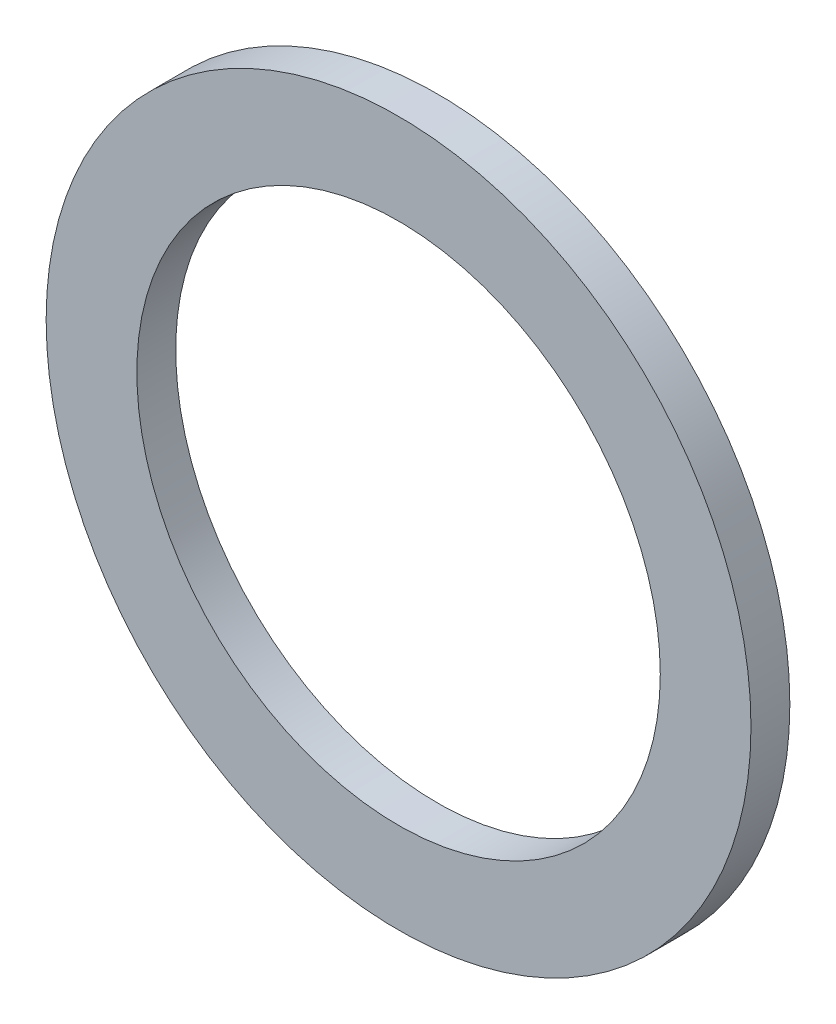
ISO-10303-21;
HEADER;
FILE_DESCRIPTION(('STEP AP214'),'2;1');
FILE_NAME('part.step','',(''),(''),'','','');
FILE_SCHEMA(('AUTOMOTIVE_DESIGN { 1 0 10303 214 1 1 1 1 }'));
ENDSEC;
DATA;
#1=APPLICATION_CONTEXT('core data for automotive mechanical design processes');
#2=APPLICATION_PROTOCOL_DEFINITION('international standard','automotive_design',2000,#1);
#3=PRODUCT_CONTEXT('',#1,'mechanical');
#4=PRODUCT('Part','Part','',(#3));
#5=PRODUCT_RELATED_PRODUCT_CATEGORY('part','',(#4));
#6=PRODUCT_DEFINITION_FORMATION('','',#4);
#7=PRODUCT_DEFINITION_CONTEXT('part definition',#1,'design');
#8=PRODUCT_DEFINITION('design','',#6,#7);
#9=PRODUCT_DEFINITION_SHAPE('','',#8);
#10=(LENGTH_UNIT() NAMED_UNIT(*) SI_UNIT(.MILLI.,.METRE.));
#11=(NAMED_UNIT(*) PLANE_ANGLE_UNIT() SI_UNIT($,.RADIAN.));
#12=(NAMED_UNIT(*) SI_UNIT($,.STERADIAN.) SOLID_ANGLE_UNIT());
#13=UNCERTAINTY_MEASURE_WITH_UNIT(LENGTH_MEASURE(1.E-05),#10,'distance_accuracy_value','');
#14=(GEOMETRIC_REPRESENTATION_CONTEXT(3) GLOBAL_UNCERTAINTY_ASSIGNED_CONTEXT((#13)) GLOBAL_UNIT_ASSIGNED_CONTEXT((#10,
#11,#12)) REPRESENTATION_CONTEXT('',''));
#15=CARTESIAN_POINT('',(0.,0.,0.));
#16=DIRECTION('',(0.,0.,1.));
#17=DIRECTION('',(1.,0.,0.));
#18=AXIS2_PLACEMENT_3D('',#15,#16,#17);
#19=CARTESIAN_POINT('',(0.,0.,1.5));
#20=DIRECTION('',(0.,0.,-1.));
#21=DIRECTION('',(-1.,0.,0.));
#22=AXIS2_PLACEMENT_3D('',#19,#20,#21);
#23=CYLINDRICAL_SURFACE('',#22,13.6);
#24=CARTESIAN_POINT('',(0.,0.,1.5));
#25=DIRECTION('',(0.,0.,1.));
#26=DIRECTION('',(1.,0.,0.));
#27=AXIS2_PLACEMENT_3D('',#24,#25,#26);
#28=CIRCLE('',#27,13.6);
#29=CARTESIAN_POINT('',(13.6,0.,1.5));
#30=VERTEX_POINT('',#29);
#31=EDGE_CURVE('E10',#30,#30,#28,.T.);
#32=ORIENTED_EDGE('',*,*,#31,.F.);
#33=EDGE_LOOP('',(#32));
#34=FACE_BOUND('',#33,.T.);
#35=CARTESIAN_POINT('',(0.,0.,0.));
#36=DIRECTION('',(0.,0.,1.));
#37=DIRECTION('',(1.,0.,0.));
#38=AXIS2_PLACEMENT_3D('',#35,#36,#37);
#39=CIRCLE('',#38,13.6);
#40=CARTESIAN_POINT('',(13.6,0.,0.));
#41=VERTEX_POINT('',#40);
#42=EDGE_CURVE('E46',#41,#41,#39,.T.);
#43=ORIENTED_EDGE('',*,*,#42,.T.);
#44=EDGE_LOOP('',(#43));
#45=FACE_BOUND('',#44,.T.);
#46=ADVANCED_FACE('F43',(#34,#45),#23,.T.);
#47=CARTESIAN_POINT('',(0.,0.,1.5));
#48=DIRECTION('',(0.,0.,1.));
#49=DIRECTION('',(1.,0.,0.));
#50=AXIS2_PLACEMENT_3D('',#47,#48,#49);
#51=PLANE('',#50);
#52=CARTESIAN_POINT('',(0.,0.,1.5));
#53=DIRECTION('',(0.,0.,1.));
#54=DIRECTION('',(1.,0.,0.));
#55=AXIS2_PLACEMENT_3D('',#52,#53,#54);
#56=CIRCLE('',#55,10.1);
#57=CARTESIAN_POINT('',(10.1,0.,1.5));
#58=VERTEX_POINT('',#57);
#59=EDGE_CURVE('E57',#58,#58,#56,.T.);
#60=ORIENTED_EDGE('',*,*,#59,.F.);
#61=EDGE_LOOP('',(#60));
#62=FACE_BOUND('',#61,.T.);
#63=ORIENTED_EDGE('',*,*,#31,.T.);
#64=EDGE_LOOP('',(#63));
#65=FACE_BOUND('',#64,.T.);
#66=ADVANCED_FACE('F74',(#62,#65),#51,.T.);
#67=CARTESIAN_POINT('',(0.,0.,0.));
#68=DIRECTION('',(0.,0.,1.));
#69=DIRECTION('',(1.,0.,0.));
#70=AXIS2_PLACEMENT_3D('',#67,#68,#69);
#71=PLANE('',#70);
#72=CARTESIAN_POINT('',(0.,0.,0.));
#73=DIRECTION('',(0.,0.,1.));
#74=DIRECTION('',(1.,0.,0.));
#75=AXIS2_PLACEMENT_3D('',#72,#73,#74);
#76=CIRCLE('',#75,10.1);
#77=CARTESIAN_POINT('',(10.1,0.,0.));
#78=VERTEX_POINT('',#77);
#79=EDGE_CURVE('E55',#78,#78,#76,.T.);
#80=ORIENTED_EDGE('',*,*,#79,.T.);
#81=EDGE_LOOP('',(#80));
#82=FACE_BOUND('',#81,.T.);
#83=ORIENTED_EDGE('',*,*,#42,.F.);
#84=EDGE_LOOP('',(#83));
#85=FACE_BOUND('',#84,.T.);
#86=ADVANCED_FACE('F65',(#82,#85),#71,.F.);
#87=CARTESIAN_POINT('',(0.,0.,0.));
#88=DIRECTION('',(0.,0.,1.));
#89=DIRECTION('',(1.,0.,0.));
#90=AXIS2_PLACEMENT_3D('',#87,#88,#89);
#91=CYLINDRICAL_SURFACE('',#90,10.1);
#92=ORIENTED_EDGE('',*,*,#79,.F.);
#93=EDGE_LOOP('',(#92));
#94=FACE_BOUND('',#93,.T.);
#95=ORIENTED_EDGE('',*,*,#59,.T.);
#96=EDGE_LOOP('',(#95));
#97=FACE_BOUND('',#96,.T.);
#98=ADVANCED_FACE('F68',(#94,#97),#91,.F.);
#99=CLOSED_SHELL('',(#46,#66,#86,#98));
#100=MANIFOLD_SOLID_BREP('B2',#99);
#101=ADVANCED_BREP_SHAPE_REPRESENTATION('',(#18,#100),#14);
#102=SHAPE_DEFINITION_REPRESENTATION(#9,#101);
ENDSEC;
END-ISO-10303-21;
